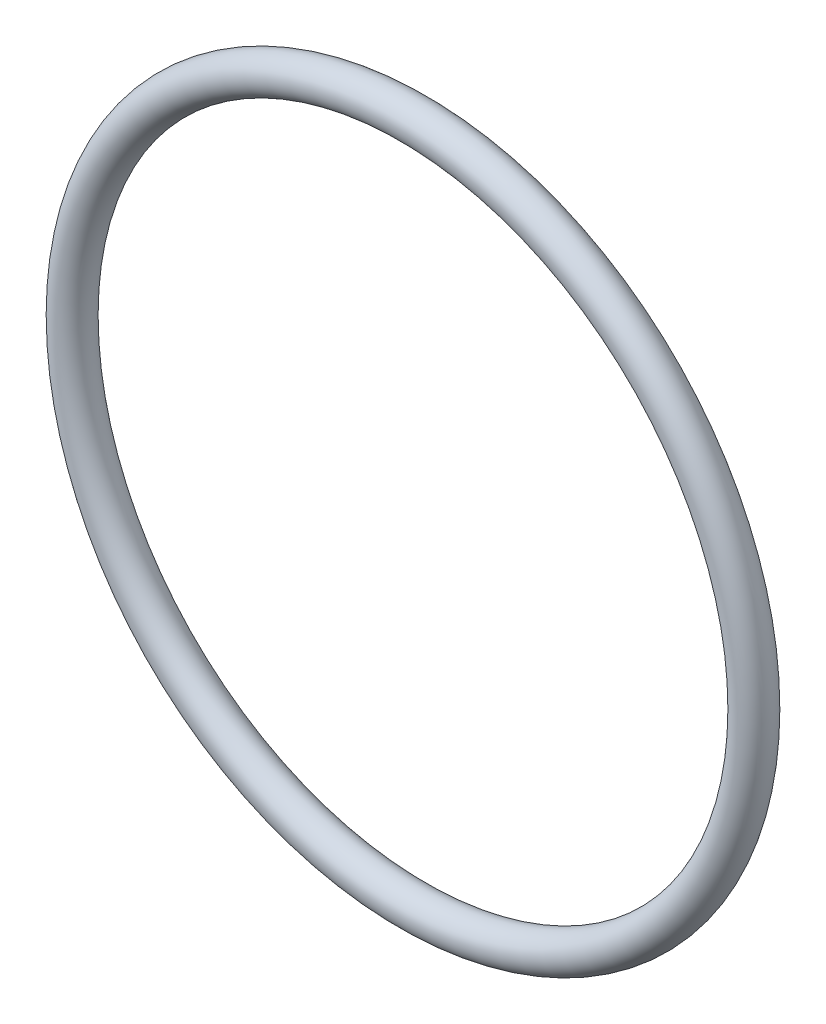
ISO-10303-21;
HEADER;
FILE_DESCRIPTION(('STEP AP214'),'2;1');
FILE_NAME('part.step','',(''),(''),'','','');
FILE_SCHEMA(('AUTOMOTIVE_DESIGN { 1 0 10303 214 1 1 1 1 }'));
ENDSEC;
DATA;
#1=APPLICATION_CONTEXT('core data for automotive mechanical design processes');
#2=APPLICATION_PROTOCOL_DEFINITION('international standard','automotive_design',2000,#1);
#3=PRODUCT_CONTEXT('',#1,'mechanical');
#4=PRODUCT('Part','Part','',(#3));
#5=PRODUCT_RELATED_PRODUCT_CATEGORY('part','',(#4));
#6=PRODUCT_DEFINITION_FORMATION('','',#4);
#7=PRODUCT_DEFINITION_CONTEXT('part definition',#1,'design');
#8=PRODUCT_DEFINITION('design','',#6,#7);
#9=PRODUCT_DEFINITION_SHAPE('','',#8);
#10=(LENGTH_UNIT() NAMED_UNIT(*) SI_UNIT(.MILLI.,.METRE.));
#11=(NAMED_UNIT(*) PLANE_ANGLE_UNIT() SI_UNIT($,.RADIAN.));
#12=(NAMED_UNIT(*) SI_UNIT($,.STERADIAN.) SOLID_ANGLE_UNIT());
#13=UNCERTAINTY_MEASURE_WITH_UNIT(LENGTH_MEASURE(1.E-05),#10,'distance_accuracy_value','');
#14=(GEOMETRIC_REPRESENTATION_CONTEXT(3) GLOBAL_UNCERTAINTY_ASSIGNED_CONTEXT((#13)) GLOBAL_UNIT_ASSIGNED_CONTEXT((#10,
#11,#12)) REPRESENTATION_CONTEXT('',''));
#15=CARTESIAN_POINT('',(0.,0.,0.));
#16=DIRECTION('',(0.,0.,1.));
#17=DIRECTION('',(1.,0.,0.));
#18=AXIS2_PLACEMENT_3D('',#15,#16,#17);
#19=CARTESIAN_POINT('',(0.,0.,0.));
#20=DIRECTION('',(0.,0.,-1.));
#21=DIRECTION('',(-1.,0.,0.));
#22=AXIS2_PLACEMENT_3D('',#19,#20,#21);
#23=TOROIDAL_SURFACE('',#22,28.75,1.55);
#24=CARTESIAN_POINT('',(-30.3,0.,0.));
#25=VERTEX_POINT('',#24);
#26=VERTEX_LOOP('',#25);
#27=FACE_BOUND('',#26,.T.);
#28=ADVANCED_FACE('F29',(#27),#23,.T.);
#29=CLOSED_SHELL('',(#28));
#30=MANIFOLD_SOLID_BREP('B2',#29);
#31=ADVANCED_BREP_SHAPE_REPRESENTATION('',(#18,#30),#14);
#32=SHAPE_DEFINITION_REPRESENTATION(#9,#31);
ENDSEC;
END-ISO-10303-21;
